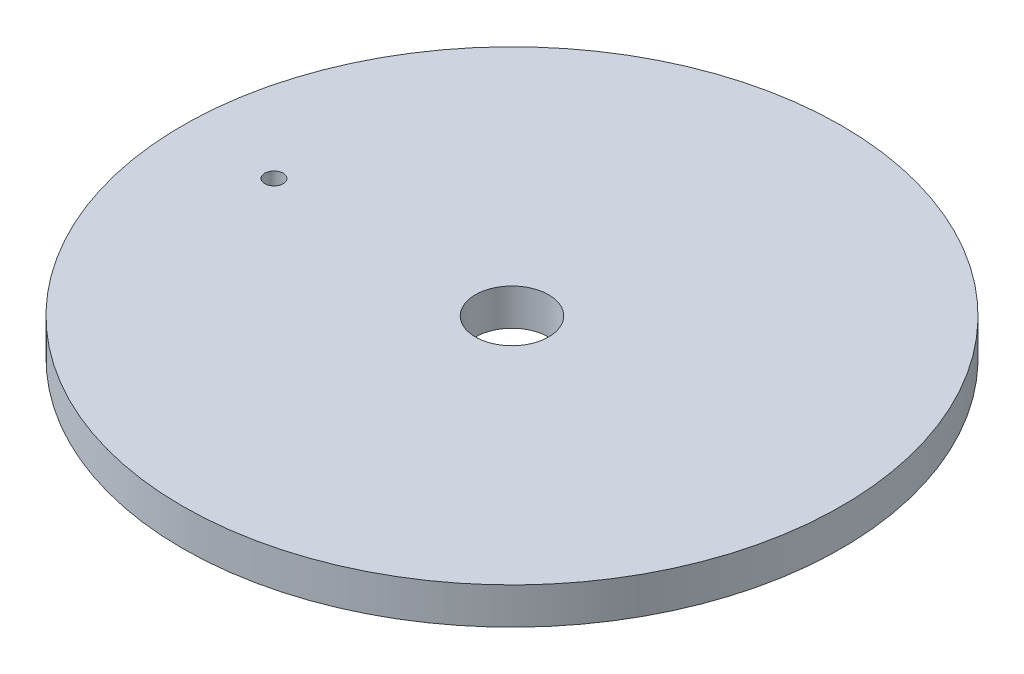
ISO-10303-21;
HEADER;
FILE_DESCRIPTION(('STEP AP214'),'2;1');
FILE_NAME('part.step','',(''),(''),'','','');
FILE_SCHEMA(('AUTOMOTIVE_DESIGN { 1 0 10303 214 1 1 1 1 }'));
ENDSEC;
DATA;
#1=APPLICATION_CONTEXT('core data for automotive mechanical design processes');
#2=APPLICATION_PROTOCOL_DEFINITION('international standard','automotive_design',2000,#1);
#3=PRODUCT_CONTEXT('',#1,'mechanical');
#4=PRODUCT('Part','Part','',(#3));
#5=PRODUCT_RELATED_PRODUCT_CATEGORY('part','',(#4));
#6=PRODUCT_DEFINITION_FORMATION('','',#4);
#7=PRODUCT_DEFINITION_CONTEXT('part definition',#1,'design');
#8=PRODUCT_DEFINITION('design','',#6,#7);
#9=PRODUCT_DEFINITION_SHAPE('','',#8);
#10=(LENGTH_UNIT() NAMED_UNIT(*) SI_UNIT(.MILLI.,.METRE.));
#11=(NAMED_UNIT(*) PLANE_ANGLE_UNIT() SI_UNIT($,.RADIAN.));
#12=(NAMED_UNIT(*) SI_UNIT($,.STERADIAN.) SOLID_ANGLE_UNIT());
#13=UNCERTAINTY_MEASURE_WITH_UNIT(LENGTH_MEASURE(1.E-05),#10,'distance_accuracy_value','');
#14=(GEOMETRIC_REPRESENTATION_CONTEXT(3) GLOBAL_UNCERTAINTY_ASSIGNED_CONTEXT((#13)) GLOBAL_UNIT_ASSIGNED_CONTEXT((#10,
#11,#12)) REPRESENTATION_CONTEXT('',''));
#15=CARTESIAN_POINT('',(0.,0.,0.));
#16=DIRECTION('',(0.,0.,1.));
#17=DIRECTION('',(1.,0.,0.));
#18=AXIS2_PLACEMENT_3D('',#15,#16,#17);
#19=CARTESIAN_POINT('',(0.,0.,0.));
#20=DIRECTION('',(0.,-1.,0.));
#21=DIRECTION('',(0.,0.,-1.));
#22=AXIS2_PLACEMENT_3D('',#19,#20,#21);
#23=CYLINDRICAL_SURFACE('',#22,6.35);
#24=CARTESIAN_POINT('',(0.,6.35000000000001,0.));
#25=DIRECTION('',(0.,-1.,0.));
#26=DIRECTION('',(0.,0.,-1.));
#27=AXIS2_PLACEMENT_3D('',#24,#25,#26);
#28=CIRCLE('',#27,6.35);
#29=CARTESIAN_POINT('',(0.,6.35000000000001,-6.35));
#30=VERTEX_POINT('',#29);
#31=EDGE_CURVE('E59',#30,#30,#28,.T.);
#32=ORIENTED_EDGE('',*,*,#31,.F.);
#33=EDGE_LOOP('',(#32));
#34=FACE_BOUND('',#33,.T.);
#35=CARTESIAN_POINT('',(0.,0.,0.));
#36=DIRECTION('',(0.,-1.,0.));
#37=DIRECTION('',(0.,0.,-1.));
#38=AXIS2_PLACEMENT_3D('',#35,#36,#37);
#39=CIRCLE('',#38,6.35);
#40=CARTESIAN_POINT('',(0.,0.,-6.35));
#41=VERTEX_POINT('',#40);
#42=EDGE_CURVE('E11',#41,#41,#39,.T.);
#43=ORIENTED_EDGE('',*,*,#42,.T.);
#44=EDGE_LOOP('',(#43));
#45=FACE_BOUND('',#44,.T.);
#46=ADVANCED_FACE('F38',(#34,#45),#23,.F.);
#47=CARTESIAN_POINT('',(-6.35,0.,0.));
#48=DIRECTION('',(0.,1.,0.));
#49=DIRECTION('',(0.,0.,1.));
#50=AXIS2_PLACEMENT_3D('',#47,#48,#49);
#51=PLANE('',#50);
#52=ORIENTED_EDGE('',*,*,#42,.F.);
#53=EDGE_LOOP('',(#52));
#54=FACE_BOUND('',#53,.T.);
#55=CARTESIAN_POINT('',(0.,0.,0.));
#56=DIRECTION('',(0.,-1.,0.));
#57=DIRECTION('',(0.,0.,-1.));
#58=AXIS2_PLACEMENT_3D('',#55,#56,#57);
#59=CIRCLE('',#58,52.5145);
#60=CARTESIAN_POINT('',(0.,0.,-52.5145));
#61=VERTEX_POINT('',#60);
#62=EDGE_CURVE('E45',#61,#61,#59,.T.);
#63=ORIENTED_EDGE('',*,*,#62,.T.);
#64=EDGE_LOOP('',(#63));
#65=FACE_BOUND('',#64,.T.);
#66=ADVANCED_FACE('F92',(#54,#65),#51,.F.);
#67=CARTESIAN_POINT('',(0.,0.,0.));
#68=DIRECTION('',(0.,-1.,0.));
#69=DIRECTION('',(0.,0.,-1.));
#70=AXIS2_PLACEMENT_3D('',#67,#68,#69);
#71=CYLINDRICAL_SURFACE('',#70,52.5145);
#72=ORIENTED_EDGE('',*,*,#62,.F.);
#73=EDGE_LOOP('',(#72));
#74=FACE_BOUND('',#73,.T.);
#75=CARTESIAN_POINT('',(0.,2.03199999999999,0.));
#76=DIRECTION('',(0.,-1.,0.));
#77=DIRECTION('',(0.,0.,-1.));
#78=AXIS2_PLACEMENT_3D('',#75,#76,#77);
#79=CIRCLE('',#78,52.5145);
#80=CARTESIAN_POINT('',(0.,2.03199999999999,-52.5145));
#81=VERTEX_POINT('',#80);
#82=EDGE_CURVE('E85',#81,#81,#79,.T.);
#83=ORIENTED_EDGE('',*,*,#82,.T.);
#84=EDGE_LOOP('',(#83));
#85=FACE_BOUND('',#84,.T.);
#86=ADVANCED_FACE('F94',(#74,#85),#71,.T.);
#87=CARTESIAN_POINT('',(-55.5625,2.03199999999999,0.));
#88=DIRECTION('',(0.,1.,0.));
#89=DIRECTION('',(0.,0.,1.));
#90=AXIS2_PLACEMENT_3D('',#87,#88,#89);
#91=PLANE('',#90);
#92=ORIENTED_EDGE('',*,*,#82,.F.);
#93=EDGE_LOOP('',(#92));
#94=FACE_BOUND('',#93,.T.);
#95=CARTESIAN_POINT('',(0.,2.03199999999999,0.));
#96=DIRECTION('',(0.,-1.,0.));
#97=DIRECTION('',(0.,0.,-1.));
#98=AXIS2_PLACEMENT_3D('',#95,#96,#97);
#99=CIRCLE('',#98,55.5625);
#100=CARTESIAN_POINT('',(0.,2.03199999999999,-55.5625));
#101=VERTEX_POINT('',#100);
#102=EDGE_CURVE('E81',#101,#101,#99,.T.);
#103=ORIENTED_EDGE('',*,*,#102,.T.);
#104=EDGE_LOOP('',(#103));
#105=FACE_BOUND('',#104,.T.);
#106=ADVANCED_FACE('F97',(#94,#105),#91,.F.);
#107=CARTESIAN_POINT('',(0.,0.,0.));
#108=DIRECTION('',(0.,-1.,0.));
#109=DIRECTION('',(0.,0.,-1.));
#110=AXIS2_PLACEMENT_3D('',#107,#108,#109);
#111=CYLINDRICAL_SURFACE('',#110,55.5625);
#112=ORIENTED_EDGE('',*,*,#102,.F.);
#113=EDGE_LOOP('',(#112));
#114=FACE_BOUND('',#113,.T.);
#115=CARTESIAN_POINT('',(0.,0.,0.));
#116=DIRECTION('',(0.,-1.,0.));
#117=DIRECTION('',(0.,0.,-1.));
#118=AXIS2_PLACEMENT_3D('',#115,#116,#117);
#119=CIRCLE('',#118,55.5625);
#120=CARTESIAN_POINT('',(0.,0.,-55.5625));
#121=VERTEX_POINT('',#120);
#122=EDGE_CURVE('E77',#121,#121,#119,.T.);
#123=ORIENTED_EDGE('',*,*,#122,.T.);
#124=EDGE_LOOP('',(#123));
#125=FACE_BOUND('',#124,.T.);
#126=ADVANCED_FACE('F103',(#114,#125),#111,.F.);
#127=CARTESIAN_POINT('',(-57.15,0.,0.));
#128=DIRECTION('',(0.,1.,0.));
#129=DIRECTION('',(0.,0.,1.));
#130=AXIS2_PLACEMENT_3D('',#127,#128,#129);
#131=PLANE('',#130);
#132=ORIENTED_EDGE('',*,*,#122,.F.);
#133=EDGE_LOOP('',(#132));
#134=FACE_BOUND('',#133,.T.);
#135=CARTESIAN_POINT('',(0.,0.,0.));
#136=DIRECTION('',(0.,-1.,0.));
#137=DIRECTION('',(0.,0.,-1.));
#138=AXIS2_PLACEMENT_3D('',#135,#136,#137);
#139=CIRCLE('',#138,57.15);
#140=CARTESIAN_POINT('',(0.,0.,-57.15));
#141=VERTEX_POINT('',#140);
#142=EDGE_CURVE('E73',#141,#141,#139,.T.);
#143=ORIENTED_EDGE('',*,*,#142,.T.);
#144=EDGE_LOOP('',(#143));
#145=FACE_BOUND('',#144,.T.);
#146=ADVANCED_FACE('F109',(#134,#145),#131,.F.);
#147=CARTESIAN_POINT('',(0.,0.,0.));
#148=DIRECTION('',(0.,-1.,0.));
#149=DIRECTION('',(0.,0.,-1.));
#150=AXIS2_PLACEMENT_3D('',#147,#148,#149);
#151=CYLINDRICAL_SURFACE('',#150,57.15);
#152=ORIENTED_EDGE('',*,*,#142,.F.);
#153=EDGE_LOOP('',(#152));
#154=FACE_BOUND('',#153,.T.);
#155=CARTESIAN_POINT('',(0.,6.35,0.));
#156=DIRECTION('',(0.,-1.,0.));
#157=DIRECTION('',(0.,0.,-1.));
#158=AXIS2_PLACEMENT_3D('',#155,#156,#157);
#159=CIRCLE('',#158,57.15);
#160=CARTESIAN_POINT('',(0.,6.35,-57.15));
#161=VERTEX_POINT('',#160);
#162=EDGE_CURVE('E65',#161,#161,#159,.T.);
#163=ORIENTED_EDGE('',*,*,#162,.T.);
#164=EDGE_LOOP('',(#163));
#165=FACE_BOUND('',#164,.T.);
#166=ADVANCED_FACE('F115',(#154,#165),#151,.T.);
#167=CARTESIAN_POINT('',(-57.15,6.35,0.));
#168=DIRECTION('',(0.,-1.,0.));
#169=DIRECTION('',(0.,0.,-1.));
#170=AXIS2_PLACEMENT_3D('',#167,#168,#169);
#171=PLANE('',#170);
#172=CARTESIAN_POINT('',(-41.275,6.35,0.));
#173=DIRECTION('',(0.,1.,0.));
#174=DIRECTION('',(0.,0.,1.));
#175=AXIS2_PLACEMENT_3D('',#172,#173,#174);
#176=CIRCLE('',#175,1.5875);
#177=CARTESIAN_POINT('',(-41.275,6.35,1.5875));
#178=VERTEX_POINT('',#177);
#179=EDGE_CURVE('E60',#178,#178,#176,.T.);
#180=ORIENTED_EDGE('',*,*,#179,.F.);
#181=EDGE_LOOP('',(#180));
#182=FACE_BOUND('',#181,.T.);
#183=ORIENTED_EDGE('',*,*,#162,.F.);
#184=EDGE_LOOP('',(#183));
#185=FACE_BOUND('',#184,.T.);
#186=ORIENTED_EDGE('',*,*,#31,.T.);
#187=EDGE_LOOP('',(#186));
#188=FACE_BOUND('',#187,.T.);
#189=ADVANCED_FACE('F52',(#182,#185,#188),#171,.F.);
#190=CARTESIAN_POINT('',(-41.275,3.175,0.));
#191=DIRECTION('',(0.,1.,0.));
#192=DIRECTION('',(0.,0.,1.));
#193=AXIS2_PLACEMENT_3D('',#190,#191,#192);
#194=CONICAL_SURFACE('',#193,1.5875,1.02974425867665);
#195=CARTESIAN_POINT('',(-41.275,2.22113376729375,0.));
#196=VERTEX_POINT('',#195);
#197=VERTEX_LOOP('',#196);
#198=FACE_BOUND('',#197,.T.);
#199=CARTESIAN_POINT('',(-41.275,3.175,0.));
#200=DIRECTION('',(0.,1.,0.));
#201=DIRECTION('',(0.,0.,1.));
#202=AXIS2_PLACEMENT_3D('',#199,#200,#201);
#203=CIRCLE('',#202,1.5875);
#204=CARTESIAN_POINT('',(-41.275,3.175,1.5875));
#205=VERTEX_POINT('',#204);
#206=EDGE_CURVE('E56',#205,#205,#203,.T.);
#207=ORIENTED_EDGE('',*,*,#206,.T.);
#208=EDGE_LOOP('',(#207));
#209=FACE_BOUND('',#208,.T.);
#210=ADVANCED_FACE('F48',(#198,#209),#194,.F.);
#211=CARTESIAN_POINT('',(-41.275,6.35,0.));
#212=DIRECTION('',(0.,1.,0.));
#213=DIRECTION('',(0.,0.,1.));
#214=AXIS2_PLACEMENT_3D('',#211,#212,#213);
#215=CYLINDRICAL_SURFACE('',#214,1.5875);
#216=ORIENTED_EDGE('',*,*,#206,.F.);
#217=EDGE_LOOP('',(#216));
#218=FACE_BOUND('',#217,.T.);
#219=ORIENTED_EDGE('',*,*,#179,.T.);
#220=EDGE_LOOP('',(#219));
#221=FACE_BOUND('',#220,.T.);
#222=ADVANCED_FACE('F51',(#218,#221),#215,.F.);
#223=CLOSED_SHELL('',(#46,#66,#86,#106,#126,#146,#166,#189,#210,#222));
#224=MANIFOLD_SOLID_BREP('B2',#223);
#225=ADVANCED_BREP_SHAPE_REPRESENTATION('',(#18,#224),#14);
#226=SHAPE_DEFINITION_REPRESENTATION(#9,#225);
ENDSEC;
END-ISO-10303-21;
